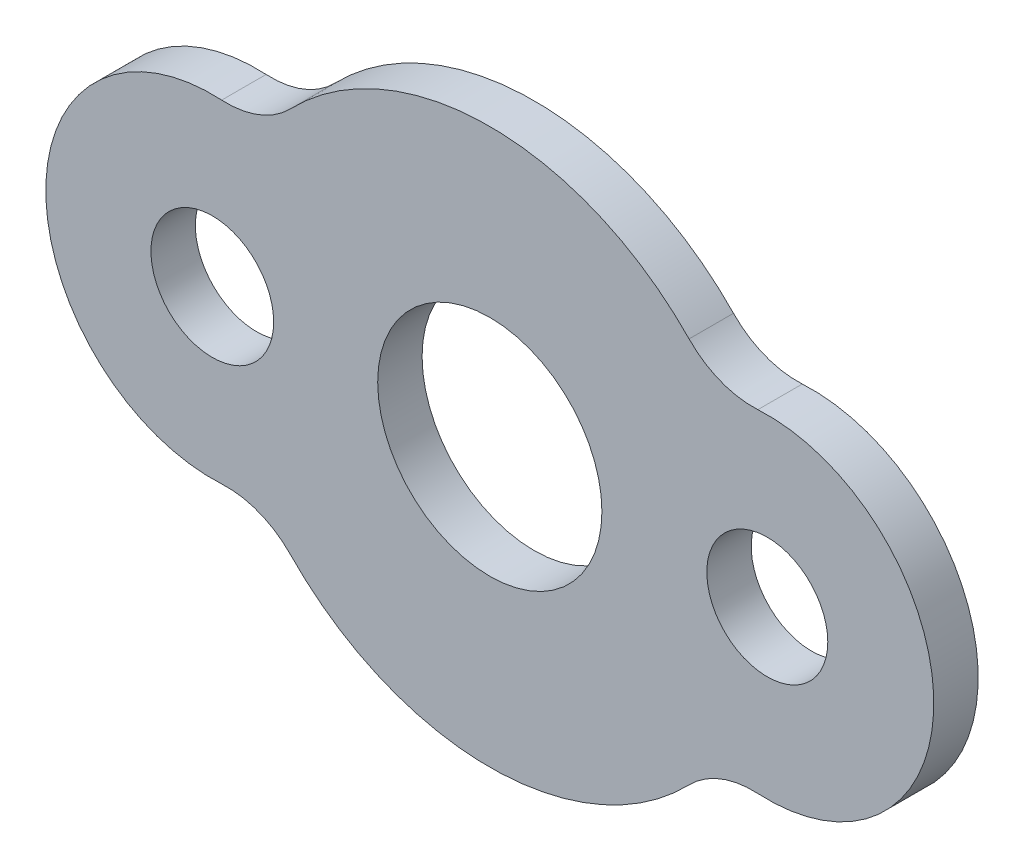
ISO-10303-21;
HEADER;
FILE_DESCRIPTION(('STEP AP214'),'2;1');
FILE_NAME('part.step','',(''),(''),'','','');
FILE_SCHEMA(('AUTOMOTIVE_DESIGN { 1 0 10303 214 1 1 1 1 }'));
ENDSEC;
DATA;
#1=APPLICATION_CONTEXT('core data for automotive mechanical design processes');
#2=APPLICATION_PROTOCOL_DEFINITION('international standard','automotive_design',2000,#1);
#3=PRODUCT_CONTEXT('',#1,'mechanical');
#4=PRODUCT('Part','Part','',(#3));
#5=PRODUCT_RELATED_PRODUCT_CATEGORY('part','',(#4));
#6=PRODUCT_DEFINITION_FORMATION('','',#4);
#7=PRODUCT_DEFINITION_CONTEXT('part definition',#1,'design');
#8=PRODUCT_DEFINITION('design','',#6,#7);
#9=PRODUCT_DEFINITION_SHAPE('','',#8);
#10=(LENGTH_UNIT() NAMED_UNIT(*) SI_UNIT(.MILLI.,.METRE.));
#11=(NAMED_UNIT(*) PLANE_ANGLE_UNIT() SI_UNIT($,.RADIAN.));
#12=(NAMED_UNIT(*) SI_UNIT($,.STERADIAN.) SOLID_ANGLE_UNIT());
#13=UNCERTAINTY_MEASURE_WITH_UNIT(LENGTH_MEASURE(1.E-05),#10,'distance_accuracy_value','');
#14=(GEOMETRIC_REPRESENTATION_CONTEXT(3) GLOBAL_UNCERTAINTY_ASSIGNED_CONTEXT((#13)) GLOBAL_UNIT_ASSIGNED_CONTEXT((#10,
#11,#12)) REPRESENTATION_CONTEXT('',''));
#15=CARTESIAN_POINT('',(0.,0.,0.));
#16=DIRECTION('',(0.,0.,1.));
#17=DIRECTION('',(1.,0.,0.));
#18=AXIS2_PLACEMENT_3D('',#15,#16,#17);
#19=CARTESIAN_POINT('',(-118.5,114.816157399558,20.));
#20=DIRECTION('',(0.,0.,-1.));
#21=DIRECTION('',(-1.,0.,0.));
#22=AXIS2_PLACEMENT_3D('',#19,#20,#21);
#23=CYLINDRICAL_SURFACE('',#22,40.);
#24=CARTESIAN_POINT('',(-118.5,114.816157399558,0.));
#25=DIRECTION('',(0.,0.,1.));
#26=DIRECTION('',(1.,0.,0.));
#27=AXIS2_PLACEMENT_3D('',#24,#25,#26);
#28=CIRCLE('',#27,40.);
#29=CARTESIAN_POINT('',(-120.760869565217,74.8801026518854,0.));
#30=VERTEX_POINT('',#29);
#31=CARTESIAN_POINT('',(-89.7727272727273,86.9819374239073,0.));
#32=VERTEX_POINT('',#31);
#33=EDGE_CURVE('E152',#30,#32,#28,.T.);
#34=ORIENTED_EDGE('',*,*,#33,.F.);
#35=DIRECTION('',(0.,0.,-1.));
#36=VECTOR('',#35,1.);
#37=CARTESIAN_POINT('',(-120.760869565217,74.8801026518854,20.));
#38=LINE('',#37,#36);
#39=CARTESIAN_POINT('',(-120.760869565217,74.8801026518854,20.));
#40=VERTEX_POINT('',#39);
#41=EDGE_CURVE('E11',#40,#30,#38,.T.);
#42=ORIENTED_EDGE('',*,*,#41,.F.);
#43=CARTESIAN_POINT('',(-118.5,114.816157399558,20.));
#44=DIRECTION('',(0.,0.,1.));
#45=DIRECTION('',(1.,0.,0.));
#46=AXIS2_PLACEMENT_3D('',#43,#44,#45);
#47=CIRCLE('',#46,40.);
#48=CARTESIAN_POINT('',(-89.7727272727273,86.9819374239073,20.));
#49=VERTEX_POINT('',#48);
#50=EDGE_CURVE('E234',#40,#49,#47,.T.);
#51=ORIENTED_EDGE('',*,*,#50,.T.);
#52=DIRECTION('',(0.,0.,-1.));
#53=VECTOR('',#52,1.);
#54=CARTESIAN_POINT('',(-89.7727272727273,86.9819374239073,20.));
#55=LINE('',#54,#53);
#56=EDGE_CURVE('E85',#49,#32,#55,.T.);
#57=ORIENTED_EDGE('',*,*,#56,.T.);
#58=EDGE_LOOP('',(#34,#42,#51,#57));
#59=FACE_BOUND('',#58,.T.);
#60=ADVANCED_FACE('F34',(#59),#23,.F.);
#61=CARTESIAN_POINT('',(-125.,0.,20.));
#62=DIRECTION('',(0.,0.,-1.));
#63=DIRECTION('',(-1.,0.,0.));
#64=AXIS2_PLACEMENT_3D('',#61,#62,#63);
#65=CYLINDRICAL_SURFACE('',#64,75.);
#66=CARTESIAN_POINT('',(-125.,0.,0.));
#67=DIRECTION('',(0.,0.,1.));
#68=DIRECTION('',(1.,0.,0.));
#69=AXIS2_PLACEMENT_3D('',#66,#67,#68);
#70=CIRCLE('',#69,75.);
#71=CARTESIAN_POINT('',(-120.760869565217,-74.8801026518854,0.));
#72=VERTEX_POINT('',#71);
#73=EDGE_CURVE('E150',#30,#72,#70,.T.);
#74=ORIENTED_EDGE('',*,*,#73,.T.);
#75=DIRECTION('',(0.,0.,-1.));
#76=VECTOR('',#75,1.);
#77=CARTESIAN_POINT('',(-120.760869565217,-74.8801026518854,20.));
#78=LINE('',#77,#76);
#79=CARTESIAN_POINT('',(-120.760869565217,-74.8801026518854,20.));
#80=VERTEX_POINT('',#79);
#81=EDGE_CURVE('E43',#80,#72,#78,.T.);
#82=ORIENTED_EDGE('',*,*,#81,.F.);
#83=CARTESIAN_POINT('',(-125.,0.,20.));
#84=DIRECTION('',(0.,0.,1.));
#85=DIRECTION('',(1.,0.,0.));
#86=AXIS2_PLACEMENT_3D('',#83,#84,#85);
#87=CIRCLE('',#86,75.);
#88=EDGE_CURVE('E236',#40,#80,#87,.T.);
#89=ORIENTED_EDGE('',*,*,#88,.F.);
#90=ORIENTED_EDGE('',*,*,#41,.T.);
#91=EDGE_LOOP('',(#74,#82,#89,#90));
#92=FACE_BOUND('',#91,.T.);
#93=ADVANCED_FACE('F151',(#92),#65,.T.);
#94=CARTESIAN_POINT('',(-118.5,-114.816157399558,20.));
#95=DIRECTION('',(0.,0.,-1.));
#96=DIRECTION('',(-1.,0.,0.));
#97=AXIS2_PLACEMENT_3D('',#94,#95,#96);
#98=CYLINDRICAL_SURFACE('',#97,40.);
#99=CARTESIAN_POINT('',(-118.5,-114.816157399558,0.));
#100=DIRECTION('',(0.,0.,1.));
#101=DIRECTION('',(1.,0.,0.));
#102=AXIS2_PLACEMENT_3D('',#99,#100,#101);
#103=CIRCLE('',#102,40.);
#104=CARTESIAN_POINT('',(-89.7727272727273,-86.9819374239073,0.));
#105=VERTEX_POINT('',#104);
#106=EDGE_CURVE('E144',#72,#105,#103,.F.);
#107=ORIENTED_EDGE('',*,*,#106,.T.);
#108=DIRECTION('',(0.,0.,-1.));
#109=VECTOR('',#108,1.);
#110=CARTESIAN_POINT('',(-89.7727272727273,-86.9819374239073,20.));
#111=LINE('',#110,#109);
#112=CARTESIAN_POINT('',(-89.7727272727273,-86.9819374239073,20.));
#113=VERTEX_POINT('',#112);
#114=EDGE_CURVE('E135',#113,#105,#111,.T.);
#115=ORIENTED_EDGE('',*,*,#114,.F.);
#116=CARTESIAN_POINT('',(-118.5,-114.816157399558,20.));
#117=DIRECTION('',(0.,0.,1.));
#118=DIRECTION('',(1.,0.,0.));
#119=AXIS2_PLACEMENT_3D('',#116,#117,#118);
#120=CIRCLE('',#119,40.);
#121=EDGE_CURVE('E146',#80,#113,#120,.F.);
#122=ORIENTED_EDGE('',*,*,#121,.F.);
#123=ORIENTED_EDGE('',*,*,#81,.T.);
#124=EDGE_LOOP('',(#107,#115,#122,#123));
#125=FACE_BOUND('',#124,.T.);
#126=ADVANCED_FACE('F142',(#125),#98,.F.);
#127=CARTESIAN_POINT('',(0.,0.,20.));
#128=DIRECTION('',(0.,0.,-1.));
#129=DIRECTION('',(-1.,0.,0.));
#130=AXIS2_PLACEMENT_3D('',#127,#128,#129);
#131=CYLINDRICAL_SURFACE('',#130,125.);
#132=CARTESIAN_POINT('',(0.,0.,0.));
#133=DIRECTION('',(0.,0.,1.));
#134=DIRECTION('',(1.,0.,0.));
#135=AXIS2_PLACEMENT_3D('',#132,#133,#134);
#136=CIRCLE('',#135,125.);
#137=CARTESIAN_POINT('',(89.7727272727272,-86.9819374239074,0.));
#138=VERTEX_POINT('',#137);
#139=EDGE_CURVE('E154',#105,#138,#136,.T.);
#140=ORIENTED_EDGE('',*,*,#139,.T.);
#141=DIRECTION('',(0.,0.,-1.));
#142=VECTOR('',#141,1.);
#143=CARTESIAN_POINT('',(89.7727272727272,-86.9819374239074,20.));
#144=LINE('',#143,#142);
#145=CARTESIAN_POINT('',(89.7727272727272,-86.9819374239074,20.));
#146=VERTEX_POINT('',#145);
#147=EDGE_CURVE('E128',#146,#138,#144,.T.);
#148=ORIENTED_EDGE('',*,*,#147,.F.);
#149=CARTESIAN_POINT('',(0.,0.,20.));
#150=DIRECTION('',(0.,0.,1.));
#151=DIRECTION('',(1.,0.,0.));
#152=AXIS2_PLACEMENT_3D('',#149,#150,#151);
#153=CIRCLE('',#152,125.);
#154=EDGE_CURVE('E242',#113,#146,#153,.T.);
#155=ORIENTED_EDGE('',*,*,#154,.F.);
#156=ORIENTED_EDGE('',*,*,#114,.T.);
#157=EDGE_LOOP('',(#140,#148,#155,#156));
#158=FACE_BOUND('',#157,.T.);
#159=ADVANCED_FACE('F208',(#158),#131,.T.);
#160=CARTESIAN_POINT('',(118.5,-114.816157399558,20.));
#161=DIRECTION('',(0.,0.,-1.));
#162=DIRECTION('',(-1.,0.,0.));
#163=AXIS2_PLACEMENT_3D('',#160,#161,#162);
#164=CYLINDRICAL_SURFACE('',#163,40.);
#165=CARTESIAN_POINT('',(118.5,-114.816157399558,0.));
#166=DIRECTION('',(0.,0.,1.));
#167=DIRECTION('',(1.,0.,0.));
#168=AXIS2_PLACEMENT_3D('',#165,#166,#167);
#169=CIRCLE('',#168,40.);
#170=CARTESIAN_POINT('',(120.760869565217,-74.8801026518855,0.));
#171=VERTEX_POINT('',#170);
#172=EDGE_CURVE('E162',#138,#171,#169,.F.);
#173=ORIENTED_EDGE('',*,*,#172,.T.);
#174=DIRECTION('',(0.,0.,-1.));
#175=VECTOR('',#174,1.);
#176=CARTESIAN_POINT('',(120.760869565217,-74.8801026518855,20.));
#177=LINE('',#176,#175);
#178=CARTESIAN_POINT('',(120.760869565217,-74.8801026518855,20.));
#179=VERTEX_POINT('',#178);
#180=EDGE_CURVE('E126',#179,#171,#177,.T.);
#181=ORIENTED_EDGE('',*,*,#180,.F.);
#182=CARTESIAN_POINT('',(118.5,-114.816157399558,20.));
#183=DIRECTION('',(0.,0.,1.));
#184=DIRECTION('',(1.,0.,0.));
#185=AXIS2_PLACEMENT_3D('',#182,#183,#184);
#186=CIRCLE('',#185,40.);
#187=EDGE_CURVE('E119',#146,#179,#186,.F.);
#188=ORIENTED_EDGE('',*,*,#187,.F.);
#189=ORIENTED_EDGE('',*,*,#147,.T.);
#190=EDGE_LOOP('',(#173,#181,#188,#189));
#191=FACE_BOUND('',#190,.T.);
#192=ADVANCED_FACE('F211',(#191),#164,.F.);
#193=CARTESIAN_POINT('',(125.,0.,20.));
#194=DIRECTION('',(0.,0.,-1.));
#195=DIRECTION('',(-1.,0.,0.));
#196=AXIS2_PLACEMENT_3D('',#193,#194,#195);
#197=CYLINDRICAL_SURFACE('',#196,75.);
#198=CARTESIAN_POINT('',(125.,0.,0.));
#199=DIRECTION('',(0.,0.,1.));
#200=DIRECTION('',(1.,0.,0.));
#201=AXIS2_PLACEMENT_3D('',#198,#199,#200);
#202=CIRCLE('',#201,75.);
#203=CARTESIAN_POINT('',(120.760869565217,74.8801026518855,0.));
#204=VERTEX_POINT('',#203);
#205=EDGE_CURVE('E125',#171,#204,#202,.T.);
#206=ORIENTED_EDGE('',*,*,#205,.T.);
#207=DIRECTION('',(0.,0.,-1.));
#208=VECTOR('',#207,1.);
#209=CARTESIAN_POINT('',(120.760869565217,74.8801026518855,20.));
#210=LINE('',#209,#208);
#211=CARTESIAN_POINT('',(120.760869565217,74.8801026518855,20.));
#212=VERTEX_POINT('',#211);
#213=EDGE_CURVE('E110',#212,#204,#210,.T.);
#214=ORIENTED_EDGE('',*,*,#213,.F.);
#215=CARTESIAN_POINT('',(125.,0.,20.));
#216=DIRECTION('',(0.,0.,1.));
#217=DIRECTION('',(1.,0.,0.));
#218=AXIS2_PLACEMENT_3D('',#215,#216,#217);
#219=CIRCLE('',#218,75.);
#220=EDGE_CURVE('E113',#179,#212,#219,.T.);
#221=ORIENTED_EDGE('',*,*,#220,.F.);
#222=ORIENTED_EDGE('',*,*,#180,.T.);
#223=EDGE_LOOP('',(#206,#214,#221,#222));
#224=FACE_BOUND('',#223,.T.);
#225=ADVANCED_FACE('F124',(#224),#197,.T.);
#226=CARTESIAN_POINT('',(118.5,114.816157399558,20.));
#227=DIRECTION('',(0.,0.,-1.));
#228=DIRECTION('',(-1.,0.,0.));
#229=AXIS2_PLACEMENT_3D('',#226,#227,#228);
#230=CYLINDRICAL_SURFACE('',#229,40.);
#231=CARTESIAN_POINT('',(118.5,114.816157399558,0.));
#232=DIRECTION('',(0.,0.,1.));
#233=DIRECTION('',(1.,0.,0.));
#234=AXIS2_PLACEMENT_3D('',#231,#232,#233);
#235=CIRCLE('',#234,40.);
#236=CARTESIAN_POINT('',(89.7727272727272,86.9819374239074,0.));
#237=VERTEX_POINT('',#236);
#238=EDGE_CURVE('E166',#204,#237,#235,.F.);
#239=ORIENTED_EDGE('',*,*,#238,.T.);
#240=DIRECTION('',(0.,0.,-1.));
#241=VECTOR('',#240,1.);
#242=CARTESIAN_POINT('',(89.7727272727272,86.9819374239074,20.));
#243=LINE('',#242,#241);
#244=CARTESIAN_POINT('',(89.7727272727272,86.9819374239074,20.));
#245=VERTEX_POINT('',#244);
#246=EDGE_CURVE('E112',#245,#237,#243,.T.);
#247=ORIENTED_EDGE('',*,*,#246,.F.);
#248=CARTESIAN_POINT('',(118.5,114.816157399558,20.));
#249=DIRECTION('',(0.,0.,1.));
#250=DIRECTION('',(1.,0.,0.));
#251=AXIS2_PLACEMENT_3D('',#248,#249,#250);
#252=CIRCLE('',#251,40.);
#253=EDGE_CURVE('E105',#212,#245,#252,.F.);
#254=ORIENTED_EDGE('',*,*,#253,.F.);
#255=ORIENTED_EDGE('',*,*,#213,.T.);
#256=EDGE_LOOP('',(#239,#247,#254,#255));
#257=FACE_BOUND('',#256,.T.);
#258=ADVANCED_FACE('F108',(#257),#230,.F.);
#259=CARTESIAN_POINT('',(0.,0.,20.));
#260=DIRECTION('',(0.,0.,-1.));
#261=DIRECTION('',(-1.,0.,0.));
#262=AXIS2_PLACEMENT_3D('',#259,#260,#261);
#263=CYLINDRICAL_SURFACE('',#262,125.);
#264=CARTESIAN_POINT('',(0.,0.,0.));
#265=DIRECTION('',(0.,0.,1.));
#266=DIRECTION('',(1.,0.,0.));
#267=AXIS2_PLACEMENT_3D('',#264,#265,#266);
#268=CIRCLE('',#267,125.);
#269=EDGE_CURVE('E78',#237,#32,#268,.T.);
#270=ORIENTED_EDGE('',*,*,#269,.T.);
#271=ORIENTED_EDGE('',*,*,#56,.F.);
#272=CARTESIAN_POINT('',(0.,0.,20.));
#273=DIRECTION('',(0.,0.,1.));
#274=DIRECTION('',(1.,0.,0.));
#275=AXIS2_PLACEMENT_3D('',#272,#273,#274);
#276=CIRCLE('',#275,125.);
#277=EDGE_CURVE('E51',#245,#49,#276,.T.);
#278=ORIENTED_EDGE('',*,*,#277,.F.);
#279=ORIENTED_EDGE('',*,*,#246,.T.);
#280=EDGE_LOOP('',(#270,#271,#278,#279));
#281=FACE_BOUND('',#280,.T.);
#282=ADVANCED_FACE('F188',(#281),#263,.T.);
#283=CARTESIAN_POINT('',(-125.,0.,20.));
#284=DIRECTION('',(0.,0.,-1.));
#285=DIRECTION('',(-1.,0.,0.));
#286=AXIS2_PLACEMENT_3D('',#283,#284,#285);
#287=CYLINDRICAL_SURFACE('',#286,27.6361523190975);
#288=CARTESIAN_POINT('',(-125.,0.,20.));
#289=DIRECTION('',(0.,0.,1.));
#290=DIRECTION('',(1.,0.,0.));
#291=AXIS2_PLACEMENT_3D('',#288,#289,#290);
#292=CIRCLE('',#291,27.6361523190975);
#293=CARTESIAN_POINT('',(-97.3638476809025,0.,20.));
#294=VERTEX_POINT('',#293);
#295=EDGE_CURVE('E233',#294,#294,#292,.T.);
#296=ORIENTED_EDGE('',*,*,#295,.T.);
#297=EDGE_LOOP('',(#296));
#298=FACE_BOUND('',#297,.T.);
#299=CARTESIAN_POINT('',(-125.,0.,0.));
#300=DIRECTION('',(0.,0.,1.));
#301=DIRECTION('',(1.,0.,0.));
#302=AXIS2_PLACEMENT_3D('',#299,#300,#301);
#303=CIRCLE('',#302,27.6361523190975);
#304=CARTESIAN_POINT('',(-97.3638476809025,0.,0.));
#305=VERTEX_POINT('',#304);
#306=EDGE_CURVE('E156',#305,#305,#303,.T.);
#307=ORIENTED_EDGE('',*,*,#306,.F.);
#308=EDGE_LOOP('',(#307));
#309=FACE_BOUND('',#308,.T.);
#310=ADVANCED_FACE('F186',(#298,#309),#287,.F.);
#311=CARTESIAN_POINT('',(125.,0.,20.));
#312=DIRECTION('',(0.,0.,-1.));
#313=DIRECTION('',(-1.,0.,0.));
#314=AXIS2_PLACEMENT_3D('',#311,#312,#313);
#315=CYLINDRICAL_SURFACE('',#314,27.2458039640822);
#316=CARTESIAN_POINT('',(125.,0.,20.));
#317=DIRECTION('',(0.,0.,1.));
#318=DIRECTION('',(1.,0.,0.));
#319=AXIS2_PLACEMENT_3D('',#316,#317,#318);
#320=CIRCLE('',#319,27.2458039640822);
#321=CARTESIAN_POINT('',(152.245803964082,0.,20.));
#322=VERTEX_POINT('',#321);
#323=EDGE_CURVE('E171',#322,#322,#320,.T.);
#324=ORIENTED_EDGE('',*,*,#323,.T.);
#325=EDGE_LOOP('',(#324));
#326=FACE_BOUND('',#325,.T.);
#327=CARTESIAN_POINT('',(125.,0.,0.));
#328=DIRECTION('',(0.,0.,1.));
#329=DIRECTION('',(1.,0.,0.));
#330=AXIS2_PLACEMENT_3D('',#327,#328,#329);
#331=CIRCLE('',#330,27.2458039640822);
#332=CARTESIAN_POINT('',(152.245803964082,0.,0.));
#333=VERTEX_POINT('',#332);
#334=EDGE_CURVE('E179',#333,#333,#331,.T.);
#335=ORIENTED_EDGE('',*,*,#334,.F.);
#336=EDGE_LOOP('',(#335));
#337=FACE_BOUND('',#336,.T.);
#338=ADVANCED_FACE('F36',(#326,#337),#315,.F.);
#339=CARTESIAN_POINT('',(0.,0.,20.));
#340=DIRECTION('',(0.,0.,-1.));
#341=DIRECTION('',(-1.,0.,0.));
#342=AXIS2_PLACEMENT_3D('',#339,#340,#341);
#343=CYLINDRICAL_SURFACE('',#342,50.5);
#344=CARTESIAN_POINT('',(0.,0.,20.));
#345=DIRECTION('',(0.,0.,1.));
#346=DIRECTION('',(1.,0.,0.));
#347=AXIS2_PLACEMENT_3D('',#344,#345,#346);
#348=CIRCLE('',#347,50.5);
#349=CARTESIAN_POINT('',(50.5,0.,20.));
#350=VERTEX_POINT('',#349);
#351=EDGE_CURVE('E172',#350,#350,#348,.T.);
#352=ORIENTED_EDGE('',*,*,#351,.T.);
#353=EDGE_LOOP('',(#352));
#354=FACE_BOUND('',#353,.T.);
#355=CARTESIAN_POINT('',(0.,0.,0.));
#356=DIRECTION('',(0.,0.,1.));
#357=DIRECTION('',(1.,0.,0.));
#358=AXIS2_PLACEMENT_3D('',#355,#356,#357);
#359=CIRCLE('',#358,50.5);
#360=CARTESIAN_POINT('',(50.5,0.,0.));
#361=VERTEX_POINT('',#360);
#362=EDGE_CURVE('E169',#361,#361,#359,.T.);
#363=ORIENTED_EDGE('',*,*,#362,.F.);
#364=EDGE_LOOP('',(#363));
#365=FACE_BOUND('',#364,.T.);
#366=ADVANCED_FACE('F194',(#354,#365),#343,.F.);
#367=CARTESIAN_POINT('',(0.,0.,20.));
#368=DIRECTION('',(0.,0.,1.));
#369=DIRECTION('',(1.,0.,0.));
#370=AXIS2_PLACEMENT_3D('',#367,#368,#369);
#371=PLANE('',#370);
#372=ORIENTED_EDGE('',*,*,#323,.F.);
#373=EDGE_LOOP('',(#372));
#374=FACE_BOUND('',#373,.T.);
#375=ORIENTED_EDGE('',*,*,#295,.F.);
#376=EDGE_LOOP('',(#375));
#377=FACE_BOUND('',#376,.T.);
#378=ORIENTED_EDGE('',*,*,#50,.F.);
#379=ORIENTED_EDGE('',*,*,#88,.T.);
#380=ORIENTED_EDGE('',*,*,#121,.T.);
#381=ORIENTED_EDGE('',*,*,#154,.T.);
#382=ORIENTED_EDGE('',*,*,#187,.T.);
#383=ORIENTED_EDGE('',*,*,#220,.T.);
#384=ORIENTED_EDGE('',*,*,#253,.T.);
#385=ORIENTED_EDGE('',*,*,#277,.T.);
#386=EDGE_LOOP('',(#378,#379,#380,#381,#382,#383,#384,#385));
#387=FACE_BOUND('',#386,.T.);
#388=ORIENTED_EDGE('',*,*,#351,.F.);
#389=EDGE_LOOP('',(#388));
#390=FACE_BOUND('',#389,.T.);
#391=ADVANCED_FACE('F116',(#374,#377,#387,#390),#371,.T.);
#392=CARTESIAN_POINT('',(0.,0.,0.));
#393=DIRECTION('',(0.,0.,1.));
#394=DIRECTION('',(1.,0.,0.));
#395=AXIS2_PLACEMENT_3D('',#392,#393,#394);
#396=PLANE('',#395);
#397=ORIENTED_EDGE('',*,*,#334,.T.);
#398=EDGE_LOOP('',(#397));
#399=FACE_BOUND('',#398,.T.);
#400=ORIENTED_EDGE('',*,*,#306,.T.);
#401=EDGE_LOOP('',(#400));
#402=FACE_BOUND('',#401,.T.);
#403=ORIENTED_EDGE('',*,*,#33,.T.);
#404=ORIENTED_EDGE('',*,*,#269,.F.);
#405=ORIENTED_EDGE('',*,*,#238,.F.);
#406=ORIENTED_EDGE('',*,*,#205,.F.);
#407=ORIENTED_EDGE('',*,*,#172,.F.);
#408=ORIENTED_EDGE('',*,*,#139,.F.);
#409=ORIENTED_EDGE('',*,*,#106,.F.);
#410=ORIENTED_EDGE('',*,*,#73,.F.);
#411=EDGE_LOOP('',(#403,#404,#405,#406,#407,#408,#409,#410));
#412=FACE_BOUND('',#411,.T.);
#413=ORIENTED_EDGE('',*,*,#362,.T.);
#414=EDGE_LOOP('',(#413));
#415=FACE_BOUND('',#414,.T.);
#416=ADVANCED_FACE('F184',(#399,#402,#412,#415),#396,.F.);
#417=CLOSED_SHELL('',(#60,#93,#126,#159,#192,#225,#258,#282,#310,#338,#366,#391,#416));
#418=MANIFOLD_SOLID_BREP('B2',#417);
#419=ADVANCED_BREP_SHAPE_REPRESENTATION('',(#18,#418),#14);
#420=SHAPE_DEFINITION_REPRESENTATION(#9,#419);
ENDSEC;
END-ISO-10303-21;
